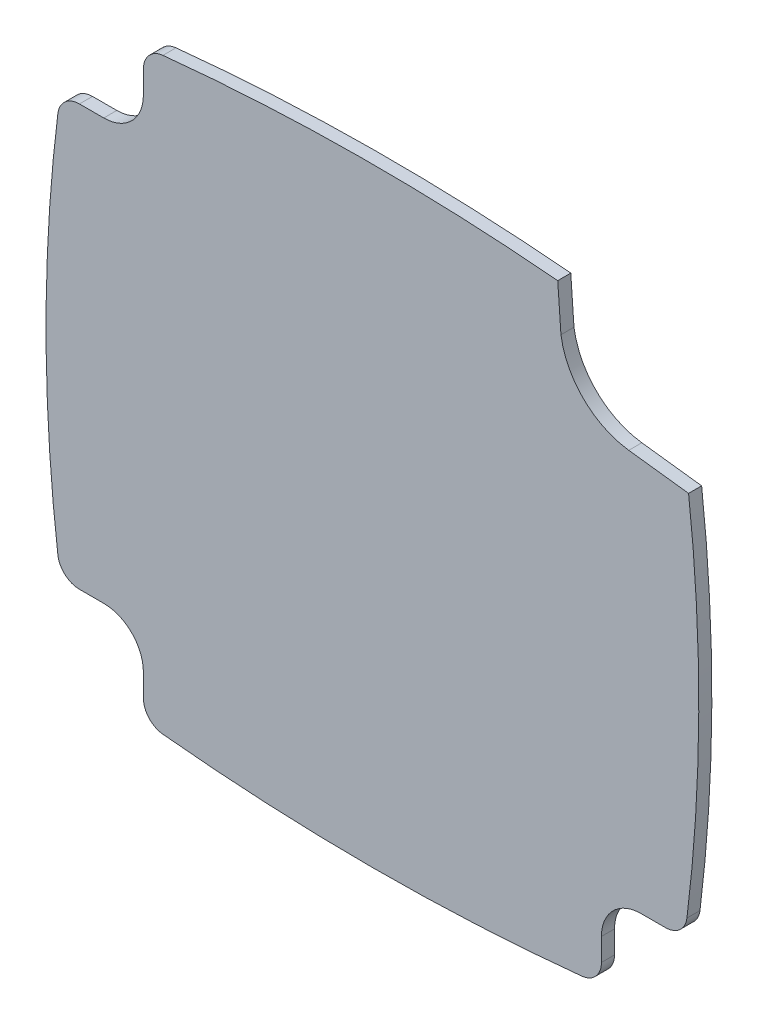
ISO-10303-21;
HEADER;
FILE_DESCRIPTION(('STEP AP214'),'2;1');
FILE_NAME('part.step','',(''),(''),'','','');
FILE_SCHEMA(('AUTOMOTIVE_DESIGN { 1 0 10303 214 1 1 1 1 }'));
ENDSEC;
DATA;
#1=APPLICATION_CONTEXT('core data for automotive mechanical design processes');
#2=APPLICATION_PROTOCOL_DEFINITION('international standard','automotive_design',2000,#1);
#3=PRODUCT_CONTEXT('',#1,'mechanical');
#4=PRODUCT('Part','Part','',(#3));
#5=PRODUCT_RELATED_PRODUCT_CATEGORY('part','',(#4));
#6=PRODUCT_DEFINITION_FORMATION('','',#4);
#7=PRODUCT_DEFINITION_CONTEXT('part definition',#1,'design');
#8=PRODUCT_DEFINITION('design','',#6,#7);
#9=PRODUCT_DEFINITION_SHAPE('','',#8);
#10=(LENGTH_UNIT() NAMED_UNIT(*) SI_UNIT(.MILLI.,.METRE.));
#11=(NAMED_UNIT(*) PLANE_ANGLE_UNIT() SI_UNIT($,.RADIAN.));
#12=(NAMED_UNIT(*) SI_UNIT($,.STERADIAN.) SOLID_ANGLE_UNIT());
#13=UNCERTAINTY_MEASURE_WITH_UNIT(LENGTH_MEASURE(1.E-05),#10,'distance_accuracy_value','');
#14=(GEOMETRIC_REPRESENTATION_CONTEXT(3) GLOBAL_UNCERTAINTY_ASSIGNED_CONTEXT((#13)) GLOBAL_UNIT_ASSIGNED_CONTEXT((#10,
#11,#12)) REPRESENTATION_CONTEXT('',''));
#15=CARTESIAN_POINT('',(0.,0.,0.));
#16=DIRECTION('',(0.,0.,1.));
#17=DIRECTION('',(1.,0.,0.));
#18=AXIS2_PLACEMENT_3D('',#15,#16,#17);
#19=CARTESIAN_POINT('',(-12.3508084480516,11.4834984549462,0.6));
#20=DIRECTION('',(0.,0.,-1.));
#21=DIRECTION('',(-1.,0.,0.));
#22=AXIS2_PLACEMENT_3D('',#19,#20,#21);
#23=CYLINDRICAL_SURFACE('',#22,1.82029488099539);
#24=CARTESIAN_POINT('',(-12.3508084480516,11.4834984549462,0.));
#25=DIRECTION('',(0.,0.,-1.));
#26=DIRECTION('',(1.,0.,0.));
#27=AXIS2_PLACEMENT_3D('',#24,#25,#26);
#28=CIRCLE('',#27,1.82029488099539);
#29=CARTESIAN_POINT('',(-10.5305135670562,11.4834984549462,0.));
#30=VERTEX_POINT('',#29);
#31=CARTESIAN_POINT('',(-12.3508084480516,9.66320357395081,0.));
#32=VERTEX_POINT('',#31);
#33=EDGE_CURVE('E213',#30,#32,#28,.T.);
#34=ORIENTED_EDGE('',*,*,#33,.T.);
#35=DIRECTION('',(0.,0.,-1.));
#36=VECTOR('',#35,1.);
#37=CARTESIAN_POINT('',(-12.3508084480516,9.66320357395081,0.6));
#38=LINE('',#37,#36);
#39=CARTESIAN_POINT('',(-12.3508084480516,9.66320357395081,0.6));
#40=VERTEX_POINT('',#39);
#41=EDGE_CURVE('E11',#40,#32,#38,.T.);
#42=ORIENTED_EDGE('',*,*,#41,.F.);
#43=CARTESIAN_POINT('',(-12.3508084480516,11.4834984549462,0.6));
#44=DIRECTION('',(0.,0.,-1.));
#45=DIRECTION('',(1.,0.,0.));
#46=AXIS2_PLACEMENT_3D('',#43,#44,#45);
#47=CIRCLE('',#46,1.82029488099539);
#48=CARTESIAN_POINT('',(-10.5305135670562,11.4834984549462,0.6));
#49=VERTEX_POINT('',#48);
#50=EDGE_CURVE('E255',#49,#40,#47,.T.);
#51=ORIENTED_EDGE('',*,*,#50,.F.);
#52=DIRECTION('',(0.,0.,-1.));
#53=VECTOR('',#52,1.);
#54=CARTESIAN_POINT('',(-10.5305135670562,11.4834984549462,0.6));
#55=LINE('',#54,#53);
#56=EDGE_CURVE('E209',#49,#30,#55,.T.);
#57=ORIENTED_EDGE('',*,*,#56,.T.);
#58=EDGE_LOOP('',(#34,#42,#51,#57));
#59=FACE_BOUND('',#58,.T.);
#60=ADVANCED_FACE('F33',(#59),#23,.F.);
#61=CARTESIAN_POINT('',(-13.4695259993499,9.66320357395081,0.6));
#62=DIRECTION('',(0.,-1.,0.));
#63=DIRECTION('',(0.,0.,-1.));
#64=AXIS2_PLACEMENT_3D('',#61,#62,#63);
#65=PLANE('',#64);
#66=DIRECTION('',(-1.,0.,0.));
#67=VECTOR('',#66,1.);
#68=CARTESIAN_POINT('',(-13.4695259993499,9.66320357395081,0.));
#69=LINE('',#68,#67);
#70=CARTESIAN_POINT('',(-13.4695259993499,9.66320357395081,0.));
#71=VERTEX_POINT('',#70);
#72=EDGE_CURVE('E216',#32,#71,#69,.T.);
#73=ORIENTED_EDGE('',*,*,#72,.T.);
#74=DIRECTION('',(0.,0.,-1.));
#75=VECTOR('',#74,1.);
#76=CARTESIAN_POINT('',(-13.4695259993499,9.66320357395081,0.6));
#77=LINE('',#76,#75);
#78=CARTESIAN_POINT('',(-13.4695259993499,9.66320357395081,0.6));
#79=VERTEX_POINT('',#78);
#80=EDGE_CURVE('E41',#79,#71,#77,.T.);
#81=ORIENTED_EDGE('',*,*,#80,.F.);
#82=DIRECTION('',(-1.,0.,0.));
#83=VECTOR('',#82,1.);
#84=CARTESIAN_POINT('',(-13.4695259993499,9.66320357395081,0.6));
#85=LINE('',#84,#83);
#86=EDGE_CURVE('E134',#40,#79,#85,.T.);
#87=ORIENTED_EDGE('',*,*,#86,.F.);
#88=ORIENTED_EDGE('',*,*,#41,.T.);
#89=EDGE_LOOP('',(#73,#81,#87,#88));
#90=FACE_BOUND('',#89,.T.);
#91=ADVANCED_FACE('F383',(#90),#65,.F.);
#92=CARTESIAN_POINT('',(-13.4695259993499,8.66320357395082,0.6));
#93=DIRECTION('',(0.,0.,-1.));
#94=DIRECTION('',(-1.,0.,0.));
#95=AXIS2_PLACEMENT_3D('',#92,#93,#94);
#96=CYLINDRICAL_SURFACE('',#95,0.999999999999987);
#97=CARTESIAN_POINT('',(-13.4695259993499,8.66320357395082,0.));
#98=DIRECTION('',(0.,0.,1.));
#99=DIRECTION('',(1.,0.,0.));
#100=AXIS2_PLACEMENT_3D('',#97,#98,#99);
#101=CIRCLE('',#100,0.999999999999987);
#102=CARTESIAN_POINT('',(-14.4619086833694,8.78639695225641,0.));
#103=VERTEX_POINT('',#102);
#104=EDGE_CURVE('E218',#71,#103,#101,.T.);
#105=ORIENTED_EDGE('',*,*,#104,.T.);
#106=DIRECTION('',(0.,0.,-1.));
#107=VECTOR('',#106,1.);
#108=CARTESIAN_POINT('',(-14.4619086833694,8.78639695225641,0.6));
#109=LINE('',#108,#107);
#110=CARTESIAN_POINT('',(-14.4619086833694,8.78639695225641,0.6));
#111=VERTEX_POINT('',#110);
#112=EDGE_CURVE('E304',#111,#103,#109,.T.);
#113=ORIENTED_EDGE('',*,*,#112,.F.);
#114=CARTESIAN_POINT('',(-13.4695259993499,8.66320357395082,0.6));
#115=DIRECTION('',(0.,0.,1.));
#116=DIRECTION('',(1.,0.,0.));
#117=AXIS2_PLACEMENT_3D('',#114,#115,#116);
#118=CIRCLE('',#117,0.999999999999987);
#119=EDGE_CURVE('E312',#79,#111,#118,.T.);
#120=ORIENTED_EDGE('',*,*,#119,.F.);
#121=ORIENTED_EDGE('',*,*,#80,.T.);
#122=EDGE_LOOP('',(#105,#113,#120,#121));
#123=FACE_BOUND('',#122,.T.);
#124=ADVANCED_FACE('F310',(#123),#96,.T.);
#125=CARTESIAN_POINT('',(56.3167996390142,0.,0.6));
#126=DIRECTION('',(0.,0.,-1.));
#127=DIRECTION('',(-1.,0.,0.));
#128=AXIS2_PLACEMENT_3D('',#125,#126,#127);
#129=CYLINDRICAL_SURFACE('',#128,71.3219904600795);
#130=CARTESIAN_POINT('',(56.3167996390142,0.,0.));
#131=DIRECTION('',(0.,0.,1.));
#132=DIRECTION('',(1.,0.,0.));
#133=AXIS2_PLACEMENT_3D('',#130,#131,#132);
#134=CIRCLE('',#133,71.3219904600795);
#135=CARTESIAN_POINT('',(-14.4619086833693,-8.7863969522564,0.));
#136=VERTEX_POINT('',#135);
#137=EDGE_CURVE('E220',#103,#136,#134,.T.);
#138=ORIENTED_EDGE('',*,*,#137,.T.);
#139=DIRECTION('',(0.,0.,-1.));
#140=VECTOR('',#139,1.);
#141=CARTESIAN_POINT('',(-14.4619086833693,-8.7863969522564,0.6));
#142=LINE('',#141,#140);
#143=CARTESIAN_POINT('',(-14.4619086833693,-8.7863969522564,0.6));
#144=VERTEX_POINT('',#143);
#145=EDGE_CURVE('E301',#144,#136,#142,.T.);
#146=ORIENTED_EDGE('',*,*,#145,.F.);
#147=CARTESIAN_POINT('',(56.3167996390142,0.,0.6));
#148=DIRECTION('',(0.,0.,1.));
#149=DIRECTION('',(1.,0.,0.));
#150=AXIS2_PLACEMENT_3D('',#147,#148,#149);
#151=CIRCLE('',#150,71.3219904600795);
#152=EDGE_CURVE('E330',#111,#144,#151,.T.);
#153=ORIENTED_EDGE('',*,*,#152,.F.);
#154=ORIENTED_EDGE('',*,*,#112,.T.);
#155=EDGE_LOOP('',(#138,#146,#153,#154));
#156=FACE_BOUND('',#155,.T.);
#157=ADVANCED_FACE('F321',(#156),#129,.T.);
#158=CARTESIAN_POINT('',(-13.4695259993499,-8.66320357395081,0.6));
#159=DIRECTION('',(0.,0.,-1.));
#160=DIRECTION('',(-1.,0.,0.));
#161=AXIS2_PLACEMENT_3D('',#158,#159,#160);
#162=CYLINDRICAL_SURFACE('',#161,0.999999999999994);
#163=CARTESIAN_POINT('',(-13.4695259993499,-8.66320357395081,0.));
#164=DIRECTION('',(0.,0.,1.));
#165=DIRECTION('',(1.,0.,0.));
#166=AXIS2_PLACEMENT_3D('',#163,#164,#165);
#167=CIRCLE('',#166,0.999999999999994);
#168=CARTESIAN_POINT('',(-13.4695259993499,-9.66320357395081,0.));
#169=VERTEX_POINT('',#168);
#170=EDGE_CURVE('E222',#136,#169,#167,.T.);
#171=ORIENTED_EDGE('',*,*,#170,.T.);
#172=DIRECTION('',(0.,0.,-1.));
#173=VECTOR('',#172,1.);
#174=CARTESIAN_POINT('',(-13.4695259993499,-9.66320357395081,0.6));
#175=LINE('',#174,#173);
#176=CARTESIAN_POINT('',(-13.4695259993499,-9.66320357395081,0.6));
#177=VERTEX_POINT('',#176);
#178=EDGE_CURVE('E298',#177,#169,#175,.T.);
#179=ORIENTED_EDGE('',*,*,#178,.F.);
#180=CARTESIAN_POINT('',(-13.4695259993499,-8.66320357395081,0.6));
#181=DIRECTION('',(0.,0.,1.));
#182=DIRECTION('',(1.,0.,0.));
#183=AXIS2_PLACEMENT_3D('',#180,#181,#182);
#184=CIRCLE('',#183,0.999999999999994);
#185=EDGE_CURVE('E327',#144,#177,#184,.T.);
#186=ORIENTED_EDGE('',*,*,#185,.F.);
#187=ORIENTED_EDGE('',*,*,#145,.T.);
#188=EDGE_LOOP('',(#171,#179,#186,#187));
#189=FACE_BOUND('',#188,.T.);
#190=ADVANCED_FACE('F325',(#189),#162,.T.);
#191=CARTESIAN_POINT('',(-13.4695259993499,-9.66320357395081,0.6));
#192=DIRECTION('',(0.,1.,0.));
#193=DIRECTION('',(0.,0.,1.));
#194=AXIS2_PLACEMENT_3D('',#191,#192,#193);
#195=PLANE('',#194);
#196=DIRECTION('',(1.,0.,0.));
#197=VECTOR('',#196,1.);
#198=CARTESIAN_POINT('',(-13.4695259993499,-9.66320357395081,0.));
#199=LINE('',#198,#197);
#200=CARTESIAN_POINT('',(-12.3508084480516,-9.66320357395081,0.));
#201=VERTEX_POINT('',#200);
#202=EDGE_CURVE('E224',#169,#201,#199,.T.);
#203=ORIENTED_EDGE('',*,*,#202,.T.);
#204=DIRECTION('',(0.,0.,-1.));
#205=VECTOR('',#204,1.);
#206=CARTESIAN_POINT('',(-12.3508084480516,-9.66320357395081,0.6));
#207=LINE('',#206,#205);
#208=CARTESIAN_POINT('',(-12.3508084480516,-9.66320357395081,0.6));
#209=VERTEX_POINT('',#208);
#210=EDGE_CURVE('E295',#209,#201,#207,.T.);
#211=ORIENTED_EDGE('',*,*,#210,.F.);
#212=DIRECTION('',(1.,0.,0.));
#213=VECTOR('',#212,1.);
#214=CARTESIAN_POINT('',(-13.4695259993499,-9.66320357395081,0.6));
#215=LINE('',#214,#213);
#216=EDGE_CURVE('E329',#177,#209,#215,.T.);
#217=ORIENTED_EDGE('',*,*,#216,.F.);
#218=ORIENTED_EDGE('',*,*,#178,.T.);
#219=EDGE_LOOP('',(#203,#211,#217,#218));
#220=FACE_BOUND('',#219,.T.);
#221=ADVANCED_FACE('F396',(#220),#195,.F.);
#222=CARTESIAN_POINT('',(-12.3508084480516,-11.4834984549462,0.6));
#223=DIRECTION('',(0.,0.,-1.));
#224=DIRECTION('',(-1.,0.,0.));
#225=AXIS2_PLACEMENT_3D('',#222,#223,#224);
#226=CYLINDRICAL_SURFACE('',#225,1.8202948809954);
#227=CARTESIAN_POINT('',(-12.3508084480516,-11.4834984549462,0.));
#228=DIRECTION('',(0.,0.,-1.));
#229=DIRECTION('',(1.,0.,0.));
#230=AXIS2_PLACEMENT_3D('',#227,#228,#229);
#231=CIRCLE('',#230,1.8202948809954);
#232=CARTESIAN_POINT('',(-10.5305135670562,-11.4834984549462,0.));
#233=VERTEX_POINT('',#232);
#234=EDGE_CURVE('E226',#201,#233,#231,.T.);
#235=ORIENTED_EDGE('',*,*,#234,.T.);
#236=DIRECTION('',(0.,0.,-1.));
#237=VECTOR('',#236,1.);
#238=CARTESIAN_POINT('',(-10.5305135670562,-11.4834984549462,0.6));
#239=LINE('',#238,#237);
#240=CARTESIAN_POINT('',(-10.5305135670562,-11.4834984549462,0.6));
#241=VERTEX_POINT('',#240);
#242=EDGE_CURVE('E292',#241,#233,#239,.T.);
#243=ORIENTED_EDGE('',*,*,#242,.F.);
#244=CARTESIAN_POINT('',(-12.3508084480516,-11.4834984549462,0.6));
#245=DIRECTION('',(0.,0.,-1.));
#246=DIRECTION('',(1.,0.,0.));
#247=AXIS2_PLACEMENT_3D('',#244,#245,#246);
#248=CIRCLE('',#247,1.8202948809954);
#249=EDGE_CURVE('E332',#209,#241,#248,.T.);
#250=ORIENTED_EDGE('',*,*,#249,.F.);
#251=ORIENTED_EDGE('',*,*,#210,.T.);
#252=EDGE_LOOP('',(#235,#243,#250,#251));
#253=FACE_BOUND('',#252,.T.);
#254=ADVANCED_FACE('F399',(#253),#226,.F.);
#255=CARTESIAN_POINT('',(-10.5305135670562,-12.5212589081855,0.6));
#256=DIRECTION('',(1.,0.,0.));
#257=DIRECTION('',(0.,0.,-1.));
#258=AXIS2_PLACEMENT_3D('',#255,#256,#257);
#259=PLANE('',#258);
#260=DIRECTION('',(0.,-1.,0.));
#261=VECTOR('',#260,1.);
#262=CARTESIAN_POINT('',(-10.5305135670562,-12.5212589081855,0.));
#263=LINE('',#262,#261);
#264=CARTESIAN_POINT('',(-10.5305135670562,-12.5212589081855,0.));
#265=VERTEX_POINT('',#264);
#266=EDGE_CURVE('E228',#233,#265,#263,.T.);
#267=ORIENTED_EDGE('',*,*,#266,.T.);
#268=DIRECTION('',(0.,0.,-1.));
#269=VECTOR('',#268,1.);
#270=CARTESIAN_POINT('',(-10.5305135670562,-12.5212589081855,0.6));
#271=LINE('',#270,#269);
#272=CARTESIAN_POINT('',(-10.5305135670562,-12.5212589081855,0.6));
#273=VERTEX_POINT('',#272);
#274=EDGE_CURVE('E289',#273,#265,#271,.T.);
#275=ORIENTED_EDGE('',*,*,#274,.F.);
#276=DIRECTION('',(0.,-1.,0.));
#277=VECTOR('',#276,1.);
#278=CARTESIAN_POINT('',(-10.5305135670562,-12.5212589081855,0.6));
#279=LINE('',#278,#277);
#280=EDGE_CURVE('E338',#241,#273,#279,.T.);
#281=ORIENTED_EDGE('',*,*,#280,.F.);
#282=ORIENTED_EDGE('',*,*,#242,.T.);
#283=EDGE_LOOP('',(#267,#275,#281,#282));
#284=FACE_BOUND('',#283,.T.);
#285=ADVANCED_FACE('F403',(#284),#259,.F.);
#286=CARTESIAN_POINT('',(-9.53051356705619,-12.5212589081855,0.6));
#287=DIRECTION('',(0.,0.,-1.));
#288=DIRECTION('',(-1.,0.,0.));
#289=AXIS2_PLACEMENT_3D('',#286,#287,#288);
#290=CYLINDRICAL_SURFACE('',#289,0.999999999999997);
#291=CARTESIAN_POINT('',(-9.53051356705619,-12.5212589081855,0.));
#292=DIRECTION('',(0.,0.,1.));
#293=DIRECTION('',(1.,0.,0.));
#294=AXIS2_PLACEMENT_3D('',#291,#292,#293);
#295=CIRCLE('',#294,0.999999999999997);
#296=CARTESIAN_POINT('',(-9.63180661690168,-13.5161155400944,0.));
#297=VERTEX_POINT('',#296);
#298=EDGE_CURVE('E230',#265,#297,#295,.T.);
#299=ORIENTED_EDGE('',*,*,#298,.T.);
#300=DIRECTION('',(0.,0.,-1.));
#301=VECTOR('',#300,1.);
#302=CARTESIAN_POINT('',(-9.63180661690168,-13.5161155400944,0.6));
#303=LINE('',#302,#301);
#304=CARTESIAN_POINT('',(-9.63180661690168,-13.5161155400944,0.6));
#305=VERTEX_POINT('',#304);
#306=EDGE_CURVE('E286',#305,#297,#303,.T.);
#307=ORIENTED_EDGE('',*,*,#306,.F.);
#308=CARTESIAN_POINT('',(-9.53051356705619,-12.5212589081855,0.6));
#309=DIRECTION('',(0.,0.,1.));
#310=DIRECTION('',(1.,0.,0.));
#311=AXIS2_PLACEMENT_3D('',#308,#309,#310);
#312=CIRCLE('',#311,0.999999999999997);
#313=EDGE_CURVE('E340',#273,#305,#312,.T.);
#314=ORIENTED_EDGE('',*,*,#313,.F.);
#315=ORIENTED_EDGE('',*,*,#274,.T.);
#316=EDGE_LOOP('',(#299,#307,#314,#315));
#317=FACE_BOUND('',#316,.T.);
#318=ADVANCED_FACE('F407',(#317),#290,.T.);
#319=CARTESIAN_POINT('',(0.,81.0833333333333,0.6));
#320=DIRECTION('',(0.,0.,-1.));
#321=DIRECTION('',(-1.,0.,0.));
#322=AXIS2_PLACEMENT_3D('',#319,#320,#321);
#323=CYLINDRICAL_SURFACE('',#322,95.0885241543985);
#324=CARTESIAN_POINT('',(0.,81.0833333333333,0.));
#325=DIRECTION('',(0.,0.,1.));
#326=DIRECTION('',(1.,0.,0.));
#327=AXIS2_PLACEMENT_3D('',#324,#325,#326);
#328=CIRCLE('',#327,95.0885241543985);
#329=CARTESIAN_POINT('',(9.63180661690164,-13.5161155400944,0.));
#330=VERTEX_POINT('',#329);
#331=EDGE_CURVE('E232',#297,#330,#328,.T.);
#332=ORIENTED_EDGE('',*,*,#331,.T.);
#333=DIRECTION('',(0.,0.,-1.));
#334=VECTOR('',#333,1.);
#335=CARTESIAN_POINT('',(9.63180661690164,-13.5161155400944,0.6));
#336=LINE('',#335,#334);
#337=CARTESIAN_POINT('',(9.63180661690164,-13.5161155400944,0.6));
#338=VERTEX_POINT('',#337);
#339=EDGE_CURVE('E283',#338,#330,#336,.T.);
#340=ORIENTED_EDGE('',*,*,#339,.F.);
#341=CARTESIAN_POINT('',(0.,81.0833333333333,0.6));
#342=DIRECTION('',(0.,0.,1.));
#343=DIRECTION('',(1.,0.,0.));
#344=AXIS2_PLACEMENT_3D('',#341,#342,#343);
#345=CIRCLE('',#344,95.0885241543985);
#346=EDGE_CURVE('E342',#305,#338,#345,.T.);
#347=ORIENTED_EDGE('',*,*,#346,.F.);
#348=ORIENTED_EDGE('',*,*,#306,.T.);
#349=EDGE_LOOP('',(#332,#340,#347,#348));
#350=FACE_BOUND('',#349,.T.);
#351=ADVANCED_FACE('F411',(#350),#323,.T.);
#352=CARTESIAN_POINT('',(9.53051356705619,-12.5212589081855,0.6));
#353=DIRECTION('',(0.,0.,-1.));
#354=DIRECTION('',(-1.,0.,0.));
#355=AXIS2_PLACEMENT_3D('',#352,#353,#354);
#356=CYLINDRICAL_SURFACE('',#355,0.999999999999996);
#357=CARTESIAN_POINT('',(9.53051356705619,-12.5212589081855,0.));
#358=DIRECTION('',(0.,0.,1.));
#359=DIRECTION('',(1.,0.,0.));
#360=AXIS2_PLACEMENT_3D('',#357,#358,#359);
#361=CIRCLE('',#360,0.999999999999996);
#362=CARTESIAN_POINT('',(10.5305135670562,-12.5212589081855,0.));
#363=VERTEX_POINT('',#362);
#364=EDGE_CURVE('E234',#330,#363,#361,.T.);
#365=ORIENTED_EDGE('',*,*,#364,.T.);
#366=DIRECTION('',(0.,0.,-1.));
#367=VECTOR('',#366,1.);
#368=CARTESIAN_POINT('',(10.5305135670562,-12.5212589081855,0.6));
#369=LINE('',#368,#367);
#370=CARTESIAN_POINT('',(10.5305135670562,-12.5212589081855,0.6));
#371=VERTEX_POINT('',#370);
#372=EDGE_CURVE('E280',#371,#363,#369,.T.);
#373=ORIENTED_EDGE('',*,*,#372,.F.);
#374=CARTESIAN_POINT('',(9.53051356705619,-12.5212589081855,0.6));
#375=DIRECTION('',(0.,0.,1.));
#376=DIRECTION('',(1.,0.,0.));
#377=AXIS2_PLACEMENT_3D('',#374,#375,#376);
#378=CIRCLE('',#377,0.999999999999996);
#379=EDGE_CURVE('E344',#338,#371,#378,.T.);
#380=ORIENTED_EDGE('',*,*,#379,.F.);
#381=ORIENTED_EDGE('',*,*,#339,.T.);
#382=EDGE_LOOP('',(#365,#373,#380,#381));
#383=FACE_BOUND('',#382,.T.);
#384=ADVANCED_FACE('F415',(#383),#356,.T.);
#385=CARTESIAN_POINT('',(10.5305135670562,-12.5212589081855,0.6));
#386=DIRECTION('',(-1.,0.,0.));
#387=DIRECTION('',(0.,0.,1.));
#388=AXIS2_PLACEMENT_3D('',#385,#386,#387);
#389=PLANE('',#388);
#390=DIRECTION('',(0.,1.,0.));
#391=VECTOR('',#390,1.);
#392=CARTESIAN_POINT('',(10.5305135670562,-12.5212589081855,0.));
#393=LINE('',#392,#391);
#394=CARTESIAN_POINT('',(10.5305135670562,-11.4834984549462,0.));
#395=VERTEX_POINT('',#394);
#396=EDGE_CURVE('E236',#363,#395,#393,.T.);
#397=ORIENTED_EDGE('',*,*,#396,.T.);
#398=DIRECTION('',(0.,0.,-1.));
#399=VECTOR('',#398,1.);
#400=CARTESIAN_POINT('',(10.5305135670562,-11.4834984549462,0.6));
#401=LINE('',#400,#399);
#402=CARTESIAN_POINT('',(10.5305135670562,-11.4834984549462,0.6));
#403=VERTEX_POINT('',#402);
#404=EDGE_CURVE('E277',#403,#395,#401,.T.);
#405=ORIENTED_EDGE('',*,*,#404,.F.);
#406=DIRECTION('',(0.,1.,0.));
#407=VECTOR('',#406,1.);
#408=CARTESIAN_POINT('',(10.5305135670562,-12.5212589081855,0.6));
#409=LINE('',#408,#407);
#410=EDGE_CURVE('E346',#371,#403,#409,.T.);
#411=ORIENTED_EDGE('',*,*,#410,.F.);
#412=ORIENTED_EDGE('',*,*,#372,.T.);
#413=EDGE_LOOP('',(#397,#405,#411,#412));
#414=FACE_BOUND('',#413,.T.);
#415=ADVANCED_FACE('F419',(#414),#389,.F.);
#416=CARTESIAN_POINT('',(12.3508084480516,-11.4834984549462,0.6));
#417=DIRECTION('',(0.,0.,-1.));
#418=DIRECTION('',(-1.,0.,0.));
#419=AXIS2_PLACEMENT_3D('',#416,#417,#418);
#420=CYLINDRICAL_SURFACE('',#419,1.82029488099539);
#421=CARTESIAN_POINT('',(12.3508084480516,-11.4834984549462,0.));
#422=DIRECTION('',(0.,0.,-1.));
#423=DIRECTION('',(1.,0.,0.));
#424=AXIS2_PLACEMENT_3D('',#421,#422,#423);
#425=CIRCLE('',#424,1.82029488099539);
#426=CARTESIAN_POINT('',(12.3508084480516,-9.66320357395081,0.));
#427=VERTEX_POINT('',#426);
#428=EDGE_CURVE('E238',#395,#427,#425,.T.);
#429=ORIENTED_EDGE('',*,*,#428,.T.);
#430=DIRECTION('',(0.,0.,-1.));
#431=VECTOR('',#430,1.);
#432=CARTESIAN_POINT('',(12.3508084480516,-9.66320357395081,0.6));
#433=LINE('',#432,#431);
#434=CARTESIAN_POINT('',(12.3508084480516,-9.66320357395081,0.6));
#435=VERTEX_POINT('',#434);
#436=EDGE_CURVE('E274',#435,#427,#433,.T.);
#437=ORIENTED_EDGE('',*,*,#436,.F.);
#438=CARTESIAN_POINT('',(12.3508084480516,-11.4834984549462,0.6));
#439=DIRECTION('',(0.,0.,-1.));
#440=DIRECTION('',(1.,0.,0.));
#441=AXIS2_PLACEMENT_3D('',#438,#439,#440);
#442=CIRCLE('',#441,1.82029488099539);
#443=EDGE_CURVE('E348',#403,#435,#442,.T.);
#444=ORIENTED_EDGE('',*,*,#443,.F.);
#445=ORIENTED_EDGE('',*,*,#404,.T.);
#446=EDGE_LOOP('',(#429,#437,#444,#445));
#447=FACE_BOUND('',#446,.T.);
#448=ADVANCED_FACE('F423',(#447),#420,.F.);
#449=CARTESIAN_POINT('',(13.4695259993499,-9.66320357395081,0.6));
#450=DIRECTION('',(0.,1.,0.));
#451=DIRECTION('',(0.,0.,1.));
#452=AXIS2_PLACEMENT_3D('',#449,#450,#451);
#453=PLANE('',#452);
#454=DIRECTION('',(1.,0.,0.));
#455=VECTOR('',#454,1.);
#456=CARTESIAN_POINT('',(13.4695259993499,-9.66320357395081,0.));
#457=LINE('',#456,#455);
#458=CARTESIAN_POINT('',(13.4695259993499,-9.66320357395081,0.));
#459=VERTEX_POINT('',#458);
#460=EDGE_CURVE('E240',#427,#459,#457,.T.);
#461=ORIENTED_EDGE('',*,*,#460,.T.);
#462=DIRECTION('',(0.,0.,-1.));
#463=VECTOR('',#462,1.);
#464=CARTESIAN_POINT('',(13.4695259993499,-9.66320357395081,0.6));
#465=LINE('',#464,#463);
#466=CARTESIAN_POINT('',(13.4695259993499,-9.66320357395081,0.6));
#467=VERTEX_POINT('',#466);
#468=EDGE_CURVE('E271',#467,#459,#465,.T.);
#469=ORIENTED_EDGE('',*,*,#468,.F.);
#470=DIRECTION('',(1.,0.,0.));
#471=VECTOR('',#470,1.);
#472=CARTESIAN_POINT('',(13.4695259993499,-9.66320357395081,0.6));
#473=LINE('',#472,#471);
#474=EDGE_CURVE('E350',#435,#467,#473,.T.);
#475=ORIENTED_EDGE('',*,*,#474,.F.);
#476=ORIENTED_EDGE('',*,*,#436,.T.);
#477=EDGE_LOOP('',(#461,#469,#475,#476));
#478=FACE_BOUND('',#477,.T.);
#479=ADVANCED_FACE('F427',(#478),#453,.F.);
#480=CARTESIAN_POINT('',(13.4695259993499,-8.66320357395081,0.6));
#481=DIRECTION('',(0.,0.,-1.));
#482=DIRECTION('',(-1.,0.,0.));
#483=AXIS2_PLACEMENT_3D('',#480,#481,#482);
#484=CYLINDRICAL_SURFACE('',#483,1.);
#485=CARTESIAN_POINT('',(13.4695259993499,-8.66320357395081,0.));
#486=DIRECTION('',(0.,0.,1.));
#487=DIRECTION('',(1.,0.,0.));
#488=AXIS2_PLACEMENT_3D('',#485,#486,#487);
#489=CIRCLE('',#488,1.);
#490=CARTESIAN_POINT('',(14.4619086833693,-8.78639695225644,0.));
#491=VERTEX_POINT('',#490);
#492=EDGE_CURVE('E242',#459,#491,#489,.T.);
#493=ORIENTED_EDGE('',*,*,#492,.T.);
#494=DIRECTION('',(0.,0.,-1.));
#495=VECTOR('',#494,1.);
#496=CARTESIAN_POINT('',(14.4619086833693,-8.78639695225644,0.6));
#497=LINE('',#496,#495);
#498=CARTESIAN_POINT('',(14.4619086833693,-8.78639695225644,0.6));
#499=VERTEX_POINT('',#498);
#500=EDGE_CURVE('E268',#499,#491,#497,.T.);
#501=ORIENTED_EDGE('',*,*,#500,.F.);
#502=CARTESIAN_POINT('',(13.4695259993499,-8.66320357395081,0.6));
#503=DIRECTION('',(0.,0.,1.));
#504=DIRECTION('',(1.,0.,0.));
#505=AXIS2_PLACEMENT_3D('',#502,#503,#504);
#506=CIRCLE('',#505,1.);
#507=EDGE_CURVE('E352',#467,#499,#506,.T.);
#508=ORIENTED_EDGE('',*,*,#507,.F.);
#509=ORIENTED_EDGE('',*,*,#468,.T.);
#510=EDGE_LOOP('',(#493,#501,#508,#509));
#511=FACE_BOUND('',#510,.T.);
#512=ADVANCED_FACE('F431',(#511),#484,.T.);
#513=CARTESIAN_POINT('',(-56.3167996390142,0.,0.6));
#514=DIRECTION('',(0.,0.,-1.));
#515=DIRECTION('',(-1.,0.,0.));
#516=AXIS2_PLACEMENT_3D('',#513,#514,#515);
#517=CYLINDRICAL_SURFACE('',#516,71.3219904600795);
#518=CARTESIAN_POINT('',(-56.3167996390142,0.,0.));
#519=DIRECTION('',(0.,0.,1.));
#520=DIRECTION('',(1.,0.,0.));
#521=AXIS2_PLACEMENT_3D('',#518,#519,#520);
#522=CIRCLE('',#521,71.3219904600795);
#523=CARTESIAN_POINT('',(14.5367833974368,8.16064299454441,0.));
#524=VERTEX_POINT('',#523);
#525=EDGE_CURVE('E244',#491,#524,#522,.T.);
#526=ORIENTED_EDGE('',*,*,#525,.T.);
#527=DIRECTION('',(0.,0.,-1.));
#528=VECTOR('',#527,1.);
#529=CARTESIAN_POINT('',(14.5367833974368,8.16064299454441,0.6));
#530=LINE('',#529,#528);
#531=CARTESIAN_POINT('',(14.5367833974368,8.16064299454441,0.6));
#532=VERTEX_POINT('',#531);
#533=EDGE_CURVE('E265',#532,#524,#530,.T.);
#534=ORIENTED_EDGE('',*,*,#533,.F.);
#535=CARTESIAN_POINT('',(-56.3167996390142,0.,0.6));
#536=DIRECTION('',(0.,0.,1.));
#537=DIRECTION('',(1.,0.,0.));
#538=AXIS2_PLACEMENT_3D('',#535,#536,#537);
#539=CIRCLE('',#538,71.3219904600795);
#540=EDGE_CURVE('E354',#499,#532,#539,.T.);
#541=ORIENTED_EDGE('',*,*,#540,.F.);
#542=ORIENTED_EDGE('',*,*,#500,.T.);
#543=EDGE_LOOP('',(#526,#534,#541,#542));
#544=FACE_BOUND('',#543,.T.);
#545=ADVANCED_FACE('F435',(#544),#517,.T.);
#546=CARTESIAN_POINT('',(14.5367833974368,8.16064299454441,0.6));
#547=DIRECTION('',(-0.122656606424086,-0.992449170940521,0.));
#548=DIRECTION('',(0.992449170940521,-0.122656606424086,0.));
#549=AXIS2_PLACEMENT_3D('',#546,#547,#548);
#550=PLANE('',#549);
#551=DIRECTION('',(-0.992449170940521,0.122656606424086,0.));
#552=VECTOR('',#551,1.);
#553=CARTESIAN_POINT('',(14.5367833974368,8.16064299454441,0.));
#554=LINE('',#553,#552);
#555=CARTESIAN_POINT('',(11.7865574219654,8.50054290572174,0.));
#556=VERTEX_POINT('',#555);
#557=EDGE_CURVE('E246',#524,#556,#554,.T.);
#558=ORIENTED_EDGE('',*,*,#557,.T.);
#559=DIRECTION('',(0.,0.,-1.));
#560=VECTOR('',#559,1.);
#561=CARTESIAN_POINT('',(11.7865574219654,8.50054290572174,0.6));
#562=LINE('',#561,#560);
#563=CARTESIAN_POINT('',(11.7865574219654,8.50054290572174,0.6));
#564=VERTEX_POINT('',#563);
#565=EDGE_CURVE('E262',#564,#556,#562,.T.);
#566=ORIENTED_EDGE('',*,*,#565,.F.);
#567=DIRECTION('',(-0.992449170940521,0.122656606424086,0.));
#568=VECTOR('',#567,1.);
#569=CARTESIAN_POINT('',(14.5367833974368,8.16064299454441,0.6));
#570=LINE('',#569,#568);
#571=EDGE_CURVE('E356',#532,#564,#570,.T.);
#572=ORIENTED_EDGE('',*,*,#571,.F.);
#573=ORIENTED_EDGE('',*,*,#533,.T.);
#574=EDGE_LOOP('',(#558,#566,#572,#573));
#575=FACE_BOUND('',#574,.T.);
#576=ADVANCED_FACE('F439',(#575),#550,.F.);
#577=CARTESIAN_POINT('',(12.2281212050964,12.0733599211421,0.6));
#578=DIRECTION('',(0.,0.,-1.));
#579=DIRECTION('',(-1.,0.,0.));
#580=AXIS2_PLACEMENT_3D('',#577,#578,#579);
#581=CYLINDRICAL_SURFACE('',#580,3.60000000003478);
#582=CARTESIAN_POINT('',(12.2281212050964,12.0733599211421,0.));
#583=DIRECTION('',(0.,0.,-1.));
#584=DIRECTION('',(1.,0.,0.));
#585=AXIS2_PLACEMENT_3D('',#582,#583,#584);
#586=CIRCLE('',#585,3.60000000003478);
#587=CARTESIAN_POINT('',(8.66765976288167,11.5412750418673,0.));
#588=VERTEX_POINT('',#587);
#589=EDGE_CURVE('E248',#556,#588,#586,.T.);
#590=ORIENTED_EDGE('',*,*,#589,.T.);
#591=DIRECTION('',(0.,0.,-1.));
#592=VECTOR('',#591,1.);
#593=CARTESIAN_POINT('',(8.66765976288167,11.5412750418673,0.6));
#594=LINE('',#593,#592);
#595=CARTESIAN_POINT('',(8.66765976288167,11.5412750418673,0.6));
#596=VERTEX_POINT('',#595);
#597=EDGE_CURVE('E259',#596,#588,#594,.T.);
#598=ORIENTED_EDGE('',*,*,#597,.F.);
#599=CARTESIAN_POINT('',(12.2281212050964,12.0733599211421,0.6));
#600=DIRECTION('',(0.,0.,-1.));
#601=DIRECTION('',(1.,0.,0.));
#602=AXIS2_PLACEMENT_3D('',#599,#600,#601);
#603=CIRCLE('',#602,3.60000000003478);
#604=EDGE_CURVE('E358',#564,#596,#603,.T.);
#605=ORIENTED_EDGE('',*,*,#604,.F.);
#606=ORIENTED_EDGE('',*,*,#565,.T.);
#607=EDGE_LOOP('',(#590,#598,#605,#606));
#608=FACE_BOUND('',#607,.T.);
#609=ADVANCED_FACE('F364',(#608),#581,.F.);
#610=CARTESIAN_POINT('',(8.66765976288167,11.5412750418673,0.6));
#611=DIRECTION('',(-0.997520616687812,-0.0703748483676315,0.));
#612=DIRECTION('',(0.0703748483676315,-0.997520616687812,0.));
#613=AXIS2_PLACEMENT_3D('',#610,#611,#612);
#614=PLANE('',#613);
#615=DIRECTION('',(-0.0703748483676315,0.997520616687812,0.));
#616=VECTOR('',#615,1.);
#617=CARTESIAN_POINT('',(8.66765976288167,11.5412750418673,0.));
#618=LINE('',#617,#616);
#619=CARTESIAN_POINT('',(8.52081932202098,13.6226488639024,0.));
#620=VERTEX_POINT('',#619);
#621=EDGE_CURVE('E250',#588,#620,#618,.T.);
#622=ORIENTED_EDGE('',*,*,#621,.T.);
#623=DIRECTION('',(0.,0.,-1.));
#624=VECTOR('',#623,1.);
#625=CARTESIAN_POINT('',(8.52081932202098,13.6226488639024,0.6));
#626=LINE('',#625,#624);
#627=CARTESIAN_POINT('',(8.52081932202098,13.6226488639024,0.6));
#628=VERTEX_POINT('',#627);
#629=EDGE_CURVE('E204',#628,#620,#626,.T.);
#630=ORIENTED_EDGE('',*,*,#629,.F.);
#631=DIRECTION('',(-0.0703748483676315,0.997520616687812,0.));
#632=VECTOR('',#631,1.);
#633=CARTESIAN_POINT('',(8.66765976288167,11.5412750418673,0.6));
#634=LINE('',#633,#632);
#635=EDGE_CURVE('E195',#596,#628,#634,.T.);
#636=ORIENTED_EDGE('',*,*,#635,.F.);
#637=ORIENTED_EDGE('',*,*,#597,.T.);
#638=EDGE_LOOP('',(#622,#630,#636,#637));
#639=FACE_BOUND('',#638,.T.);
#640=ADVANCED_FACE('F368',(#639),#614,.F.);
#641=CARTESIAN_POINT('',(0.,-81.0833333333333,0.6));
#642=DIRECTION('',(0.,0.,-1.));
#643=DIRECTION('',(-1.,0.,0.));
#644=AXIS2_PLACEMENT_3D('',#641,#642,#643);
#645=CYLINDRICAL_SURFACE('',#644,95.0885241543986);
#646=CARTESIAN_POINT('',(0.,-81.0833333333333,0.));
#647=DIRECTION('',(0.,0.,1.));
#648=DIRECTION('',(1.,0.,0.));
#649=AXIS2_PLACEMENT_3D('',#646,#647,#648);
#650=CIRCLE('',#649,95.0885241543986);
#651=CARTESIAN_POINT('',(-9.63180661690164,13.5161155400944,0.));
#652=VERTEX_POINT('',#651);
#653=EDGE_CURVE('E203',#620,#652,#650,.T.);
#654=ORIENTED_EDGE('',*,*,#653,.T.);
#655=DIRECTION('',(0.,0.,-1.));
#656=VECTOR('',#655,1.);
#657=CARTESIAN_POINT('',(-9.63180661690164,13.5161155400944,0.6));
#658=LINE('',#657,#656);
#659=CARTESIAN_POINT('',(-9.63180661690164,13.5161155400944,0.6));
#660=VERTEX_POINT('',#659);
#661=EDGE_CURVE('E200',#660,#652,#658,.T.);
#662=ORIENTED_EDGE('',*,*,#661,.F.);
#663=CARTESIAN_POINT('',(0.,-81.0833333333333,0.6));
#664=DIRECTION('',(0.,0.,1.));
#665=DIRECTION('',(1.,0.,0.));
#666=AXIS2_PLACEMENT_3D('',#663,#664,#665);
#667=CIRCLE('',#666,95.0885241543986);
#668=EDGE_CURVE('E189',#628,#660,#667,.T.);
#669=ORIENTED_EDGE('',*,*,#668,.F.);
#670=ORIENTED_EDGE('',*,*,#629,.T.);
#671=EDGE_LOOP('',(#654,#662,#669,#670));
#672=FACE_BOUND('',#671,.T.);
#673=ADVANCED_FACE('F201',(#672),#645,.T.);
#674=CARTESIAN_POINT('',(-9.53051356705619,12.5212589081855,0.6));
#675=DIRECTION('',(0.,0.,-1.));
#676=DIRECTION('',(-1.,0.,0.));
#677=AXIS2_PLACEMENT_3D('',#674,#675,#676);
#678=CYLINDRICAL_SURFACE('',#677,1.00000000000001);
#679=CARTESIAN_POINT('',(-9.53051356705619,12.5212589081855,0.));
#680=DIRECTION('',(0.,0.,1.));
#681=DIRECTION('',(1.,0.,0.));
#682=AXIS2_PLACEMENT_3D('',#679,#680,#681);
#683=CIRCLE('',#682,1.00000000000001);
#684=CARTESIAN_POINT('',(-10.5305135670562,12.5212589081855,0.));
#685=VERTEX_POINT('',#684);
#686=EDGE_CURVE('E120',#652,#685,#683,.T.);
#687=ORIENTED_EDGE('',*,*,#686,.T.);
#688=DIRECTION('',(0.,0.,-1.));
#689=VECTOR('',#688,1.);
#690=CARTESIAN_POINT('',(-10.5305135670562,12.5212589081855,0.6));
#691=LINE('',#690,#689);
#692=CARTESIAN_POINT('',(-10.5305135670562,12.5212589081855,0.6));
#693=VERTEX_POINT('',#692);
#694=EDGE_CURVE('E205',#693,#685,#691,.T.);
#695=ORIENTED_EDGE('',*,*,#694,.F.);
#696=CARTESIAN_POINT('',(-9.53051356705619,12.5212589081855,0.6));
#697=DIRECTION('',(0.,0.,1.));
#698=DIRECTION('',(1.,0.,0.));
#699=AXIS2_PLACEMENT_3D('',#696,#697,#698);
#700=CIRCLE('',#699,1.00000000000001);
#701=EDGE_CURVE('E193',#660,#693,#700,.T.);
#702=ORIENTED_EDGE('',*,*,#701,.F.);
#703=ORIENTED_EDGE('',*,*,#661,.T.);
#704=EDGE_LOOP('',(#687,#695,#702,#703));
#705=FACE_BOUND('',#704,.T.);
#706=ADVANCED_FACE('F207',(#705),#678,.T.);
#707=CARTESIAN_POINT('',(-10.5305135670562,12.5212589081855,0.6));
#708=DIRECTION('',(1.,0.,0.));
#709=DIRECTION('',(0.,0.,-1.));
#710=AXIS2_PLACEMENT_3D('',#707,#708,#709);
#711=PLANE('',#710);
#712=DIRECTION('',(0.,-1.,0.));
#713=VECTOR('',#712,1.);
#714=CARTESIAN_POINT('',(-10.5305135670562,12.5212589081855,0.));
#715=LINE('',#714,#713);
#716=EDGE_CURVE('E126',#685,#30,#715,.T.);
#717=ORIENTED_EDGE('',*,*,#716,.T.);
#718=ORIENTED_EDGE('',*,*,#56,.F.);
#719=DIRECTION('',(0.,-1.,0.));
#720=VECTOR('',#719,1.);
#721=CARTESIAN_POINT('',(-10.5305135670562,12.5212589081855,0.6));
#722=LINE('',#721,#720);
#723=EDGE_CURVE('E49',#693,#49,#722,.T.);
#724=ORIENTED_EDGE('',*,*,#723,.F.);
#725=ORIENTED_EDGE('',*,*,#694,.T.);
#726=EDGE_LOOP('',(#717,#718,#724,#725));
#727=FACE_BOUND('',#726,.T.);
#728=ADVANCED_FACE('F372',(#727),#711,.F.);
#729=CARTESIAN_POINT('',(-12.3508084480516,11.4834984549462,0.6));
#730=DIRECTION('',(0.,0.,1.));
#731=DIRECTION('',(1.,0.,0.));
#732=AXIS2_PLACEMENT_3D('',#729,#730,#731);
#733=PLANE('',#732);
#734=ORIENTED_EDGE('',*,*,#50,.T.);
#735=ORIENTED_EDGE('',*,*,#86,.T.);
#736=ORIENTED_EDGE('',*,*,#119,.T.);
#737=ORIENTED_EDGE('',*,*,#152,.T.);
#738=ORIENTED_EDGE('',*,*,#185,.T.);
#739=ORIENTED_EDGE('',*,*,#216,.T.);
#740=ORIENTED_EDGE('',*,*,#249,.T.);
#741=ORIENTED_EDGE('',*,*,#280,.T.);
#742=ORIENTED_EDGE('',*,*,#313,.T.);
#743=ORIENTED_EDGE('',*,*,#346,.T.);
#744=ORIENTED_EDGE('',*,*,#379,.T.);
#745=ORIENTED_EDGE('',*,*,#410,.T.);
#746=ORIENTED_EDGE('',*,*,#443,.T.);
#747=ORIENTED_EDGE('',*,*,#474,.T.);
#748=ORIENTED_EDGE('',*,*,#507,.T.);
#749=ORIENTED_EDGE('',*,*,#540,.T.);
#750=ORIENTED_EDGE('',*,*,#571,.T.);
#751=ORIENTED_EDGE('',*,*,#604,.T.);
#752=ORIENTED_EDGE('',*,*,#635,.T.);
#753=ORIENTED_EDGE('',*,*,#668,.T.);
#754=ORIENTED_EDGE('',*,*,#701,.T.);
#755=ORIENTED_EDGE('',*,*,#723,.T.);
#756=EDGE_LOOP('',(#734,#735,#736,#737,#738,#739,#740,#741,#742,#743,#744,#745,#746,#747,#748,
#749,#750,#751,#752,#753,#754,#755));
#757=FACE_BOUND('',#756,.T.);
#758=ADVANCED_FACE('F191',(#757),#733,.T.);
#759=CARTESIAN_POINT('',(-12.3508084480516,11.4834984549462,0.));
#760=DIRECTION('',(0.,0.,1.));
#761=DIRECTION('',(1.,0.,0.));
#762=AXIS2_PLACEMENT_3D('',#759,#760,#761);
#763=PLANE('',#762);
#764=ORIENTED_EDGE('',*,*,#33,.F.);
#765=ORIENTED_EDGE('',*,*,#716,.F.);
#766=ORIENTED_EDGE('',*,*,#686,.F.);
#767=ORIENTED_EDGE('',*,*,#653,.F.);
#768=ORIENTED_EDGE('',*,*,#621,.F.);
#769=ORIENTED_EDGE('',*,*,#589,.F.);
#770=ORIENTED_EDGE('',*,*,#557,.F.);
#771=ORIENTED_EDGE('',*,*,#525,.F.);
#772=ORIENTED_EDGE('',*,*,#492,.F.);
#773=ORIENTED_EDGE('',*,*,#460,.F.);
#774=ORIENTED_EDGE('',*,*,#428,.F.);
#775=ORIENTED_EDGE('',*,*,#396,.F.);
#776=ORIENTED_EDGE('',*,*,#364,.F.);
#777=ORIENTED_EDGE('',*,*,#331,.F.);
#778=ORIENTED_EDGE('',*,*,#298,.F.);
#779=ORIENTED_EDGE('',*,*,#266,.F.);
#780=ORIENTED_EDGE('',*,*,#234,.F.);
#781=ORIENTED_EDGE('',*,*,#202,.F.);
#782=ORIENTED_EDGE('',*,*,#170,.F.);
#783=ORIENTED_EDGE('',*,*,#137,.F.);
#784=ORIENTED_EDGE('',*,*,#104,.F.);
#785=ORIENTED_EDGE('',*,*,#72,.F.);
#786=EDGE_LOOP('',(#764,#765,#766,#767,#768,#769,#770,#771,#772,#773,#774,#775,#776,#777,#778,
#779,#780,#781,#782,#783,#784,#785));
#787=FACE_BOUND('',#786,.T.);
#788=ADVANCED_FACE('F316',(#787),#763,.F.);
#789=CLOSED_SHELL('',(#60,#91,#124,#157,#190,#221,#254,#285,#318,#351,#384,#415,#448,#479,#512,
#545,#576,#609,#640,#673,#706,#728,#758,#788));
#790=MANIFOLD_SOLID_BREP('B2',#789);
#791=ADVANCED_BREP_SHAPE_REPRESENTATION('',(#18,#790),#14);
#792=SHAPE_DEFINITION_REPRESENTATION(#9,#791);
ENDSEC;
END-ISO-10303-21;
